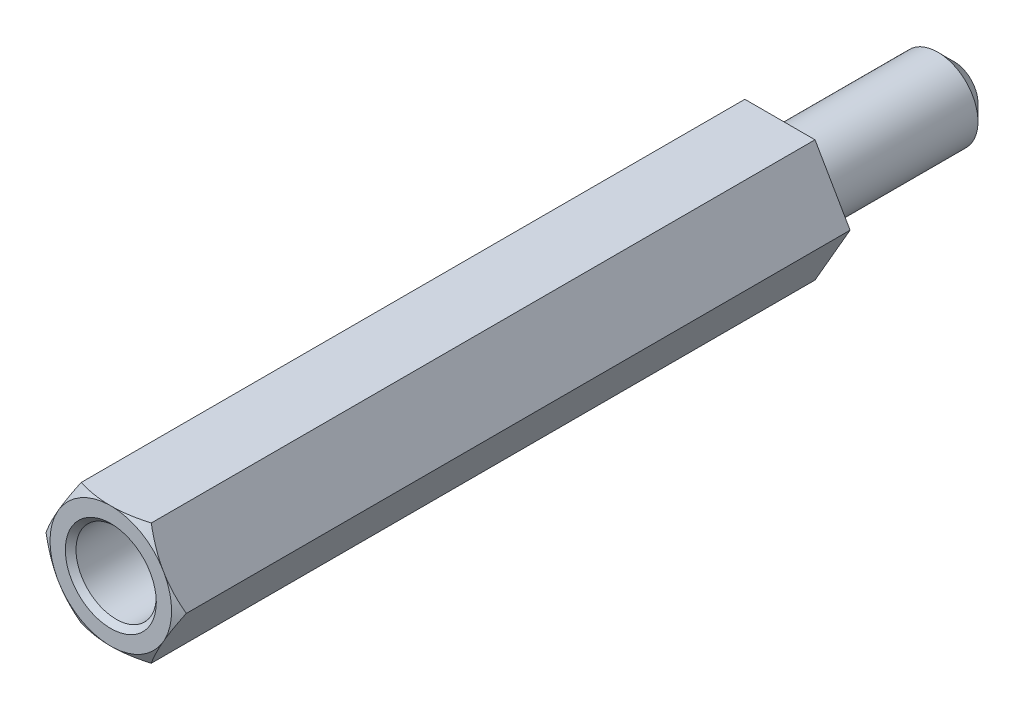
ISO-10303-21;
HEADER;
FILE_DESCRIPTION(('STEP AP214'),'2;1');
FILE_NAME('part.step','',(''),(''),'','','');
FILE_SCHEMA(('AUTOMOTIVE_DESIGN { 1 0 10303 214 1 1 1 1 }'));
ENDSEC;
DATA;
#1=APPLICATION_CONTEXT('core data for automotive mechanical design processes');
#2=APPLICATION_PROTOCOL_DEFINITION('international standard','automotive_design',2000,#1);
#3=PRODUCT_CONTEXT('',#1,'mechanical');
#4=PRODUCT('Part','Part','',(#3));
#5=PRODUCT_RELATED_PRODUCT_CATEGORY('part','',(#4));
#6=PRODUCT_DEFINITION_FORMATION('','',#4);
#7=PRODUCT_DEFINITION_CONTEXT('part definition',#1,'design');
#8=PRODUCT_DEFINITION('design','',#6,#7);
#9=PRODUCT_DEFINITION_SHAPE('','',#8);
#10=(LENGTH_UNIT() NAMED_UNIT(*) SI_UNIT(.MILLI.,.METRE.));
#11=(NAMED_UNIT(*) PLANE_ANGLE_UNIT() SI_UNIT($,.RADIAN.));
#12=(NAMED_UNIT(*) SI_UNIT($,.STERADIAN.) SOLID_ANGLE_UNIT());
#13=UNCERTAINTY_MEASURE_WITH_UNIT(LENGTH_MEASURE(1.E-05),#10,'distance_accuracy_value','');
#14=(GEOMETRIC_REPRESENTATION_CONTEXT(3) GLOBAL_UNCERTAINTY_ASSIGNED_CONTEXT((#13)) GLOBAL_UNIT_ASSIGNED_CONTEXT((#10,
#11,#12)) REPRESENTATION_CONTEXT('',''));
#15=CARTESIAN_POINT('',(0.,0.,0.));
#16=DIRECTION('',(0.,0.,1.));
#17=DIRECTION('',(1.,0.,0.));
#18=AXIS2_PLACEMENT_3D('',#15,#16,#17);
#19=CARTESIAN_POINT('',(0.,0.,25.));
#20=DIRECTION('',(0.,0.,1.));
#21=DIRECTION('',(1.,0.,0.));
#22=AXIS2_PLACEMENT_3D('',#19,#20,#21);
#23=PLANE('',#22);
#24=CARTESIAN_POINT('',(0.,0.,25.));
#25=DIRECTION('',(0.,0.,1.));
#26=DIRECTION('',(1.,0.,0.));
#27=AXIS2_PLACEMENT_3D('',#24,#25,#26);
#28=CIRCLE('',#27,1.7);
#29=CARTESIAN_POINT('',(1.7,0.,25.));
#30=VERTEX_POINT('',#29);
#31=EDGE_CURVE('E166',#30,#30,#28,.F.);
#32=ORIENTED_EDGE('',*,*,#31,.T.);
#33=EDGE_LOOP('',(#32));
#34=FACE_BOUND('',#33,.T.);
#35=CARTESIAN_POINT('',(0.,0.,25.));
#36=DIRECTION('',(0.,0.,1.));
#37=DIRECTION('',(1.,0.,0.));
#38=AXIS2_PLACEMENT_3D('',#35,#36,#37);
#39=CIRCLE('',#38,2.2711702221209);
#40=CARTESIAN_POINT('',(1.92942846272878,-1.19813187298426,25.));
#41=VERTEX_POINT('',#40);
#42=CARTESIAN_POINT('',(0.0728984077241233,-2.27,25.));
#43=VERTEX_POINT('',#42);
#44=EDGE_CURVE('E165',#41,#43,#39,.F.);
#45=ORIENTED_EDGE('',*,*,#44,.F.);
#46=DIRECTION('',(0.499999999999995,0.866025403784442,0.));
#47=VECTOR('',#46,1.);
#48=CARTESIAN_POINT('',(1.31058511106048,-2.26999999999999,25.));
#49=LINE('',#48,#47);
#50=CARTESIAN_POINT('',(2.0023268704526,-1.07186812701572,25.));
#51=VERTEX_POINT('',#50);
#52=EDGE_CURVE('E309',#41,#51,#49,.T.);
#53=ORIENTED_EDGE('',*,*,#52,.T.);
#54=CARTESIAN_POINT('',(2.00232687045273,1.07186812701549,25.));
#55=VERTEX_POINT('',#54);
#56=EDGE_CURVE('E162',#55,#51,#39,.F.);
#57=ORIENTED_EDGE('',*,*,#56,.F.);
#58=DIRECTION('',(-0.500000000000001,0.866025403784438,0.));
#59=VECTOR('',#58,1.);
#60=CARTESIAN_POINT('',(2.6211702221209,0.,25.));
#61=LINE('',#60,#59);
#62=CARTESIAN_POINT('',(1.92942846272862,1.19813187298452,25.));
#63=VERTEX_POINT('',#62);
#64=EDGE_CURVE('E321',#55,#63,#61,.T.);
#65=ORIENTED_EDGE('',*,*,#64,.T.);
#66=CARTESIAN_POINT('',(0.0728984077240917,2.27,25.));
#67=VERTEX_POINT('',#66);
#68=EDGE_CURVE('E164',#67,#63,#39,.F.);
#69=ORIENTED_EDGE('',*,*,#68,.F.);
#70=DIRECTION('',(-1.,0.,0.));
#71=VECTOR('',#70,1.);
#72=CARTESIAN_POINT('',(1.31058511106045,2.27,25.));
#73=LINE('',#72,#71);
#74=CARTESIAN_POINT('',(-0.0728984077241075,2.27,25.));
#75=VERTEX_POINT('',#74);
#76=EDGE_CURVE('E316',#67,#75,#73,.T.);
#77=ORIENTED_EDGE('',*,*,#76,.T.);
#78=CARTESIAN_POINT('',(-1.92942846272863,1.19813187298449,25.));
#79=VERTEX_POINT('',#78);
#80=EDGE_CURVE('E341',#79,#75,#39,.F.);
#81=ORIENTED_EDGE('',*,*,#80,.F.);
#82=DIRECTION('',(-0.499999999999995,-0.866025403784442,0.));
#83=VECTOR('',#82,1.);
#84=CARTESIAN_POINT('',(-1.31058511106046,2.27,25.));
#85=LINE('',#84,#83);
#86=CARTESIAN_POINT('',(-2.00232687045273,1.07186812701548,25.));
#87=VERTEX_POINT('',#86);
#88=EDGE_CURVE('E315',#79,#87,#85,.T.);
#89=ORIENTED_EDGE('',*,*,#88,.T.);
#90=CARTESIAN_POINT('',(-2.00232687045272,-1.0718681270155,25.));
#91=VERTEX_POINT('',#90);
#92=EDGE_CURVE('E126',#91,#87,#39,.F.);
#93=ORIENTED_EDGE('',*,*,#92,.F.);
#94=DIRECTION('',(0.500000000000007,-0.866025403784435,0.));
#95=VECTOR('',#94,1.);
#96=CARTESIAN_POINT('',(-2.6211702221209,0.,25.));
#97=LINE('',#96,#95);
#98=CARTESIAN_POINT('',(-1.92942846272861,-1.19813187298453,25.));
#99=VERTEX_POINT('',#98);
#100=EDGE_CURVE('E142',#91,#99,#97,.T.);
#101=ORIENTED_EDGE('',*,*,#100,.T.);
#102=CARTESIAN_POINT('',(-0.0728984077240759,-2.27,25.));
#103=VERTEX_POINT('',#102);
#104=EDGE_CURVE('E332',#103,#99,#39,.F.);
#105=ORIENTED_EDGE('',*,*,#104,.F.);
#106=DIRECTION('',(1.,0.,0.));
#107=VECTOR('',#106,1.);
#108=CARTESIAN_POINT('',(-1.31058511106043,-2.27000000000001,25.));
#109=LINE('',#108,#107);
#110=EDGE_CURVE('E301',#103,#43,#109,.T.);
#111=ORIENTED_EDGE('',*,*,#110,.T.);
#112=EDGE_LOOP('',(#45,#53,#57,#65,#69,#77,#81,#89,#93,#101,#105,#111));
#113=FACE_BOUND('',#112,.T.);
#114=ADVANCED_FACE('F37',(#34,#113),#23,.T.);
#115=CARTESIAN_POINT('',(1.31058511106048,-2.26999999999999,25.));
#116=DIRECTION('',(-0.866025403784442,0.499999999999995,0.));
#117=DIRECTION('',(-0.499999999999995,-0.866025403784442,0.));
#118=AXIS2_PLACEMENT_3D('',#115,#116,#117);
#119=PLANE('',#118);
#120=DIRECTION('',(0.,0.,-1.));
#121=VECTOR('',#120,1.);
#122=CARTESIAN_POINT('',(2.6211702221209,0.,25.));
#123=LINE('',#122,#121);
#124=CARTESIAN_POINT('',(2.6211702221209,0.,24.8));
#125=VERTEX_POINT('',#124);
#126=CARTESIAN_POINT('',(2.6211702221209,0.,0.));
#127=VERTEX_POINT('',#126);
#128=EDGE_CURVE('E160',#125,#127,#123,.T.);
#129=ORIENTED_EDGE('',*,*,#128,.F.);
#130=CARTESIAN_POINT('',(3.53192502802619,1.5774735970655,24.0874155357182));
#131=CARTESIAN_POINT('',(3.49038683177578,1.50552733070503,24.1258459368283));
#132=CARTESIAN_POINT('',(3.44875020540645,1.43341057837758,24.1638565423728));
#133=CARTESIAN_POINT('',(3.36523806633925,1.28876331046444,24.2388408708484));
#134=CARTESIAN_POINT('',(3.32336252393505,1.21623274342586,24.2758144613019));
#135=CARTESIAN_POINT('',(3.2392041639013,1.07046618796572,24.3486360571844));
#136=CARTESIAN_POINT('',(3.19692046373752,0.997228670950053,24.3844800017565));
#137=CARTESIAN_POINT('',(3.11203872815441,0.850209192285469,24.4546361454567));
#138=CARTESIAN_POINT('',(3.06944070287604,0.776427248201227,24.4889483937519));
#139=CARTESIAN_POINT('',(2.93902958582733,0.550548567601059,24.5907324723442));
#140=CARTESIAN_POINT('',(2.85063034563923,0.397436592244786,24.6552582519314));
#141=CARTESIAN_POINT('',(2.67192637782696,0.0879122404797772,24.7724545253547));
#142=CARTESIAN_POINT('',(2.58162393222904,-0.0684961833435604,24.8251384219436));
#143=CARTESIAN_POINT('',(2.42693241398783,-0.336429752437301,24.8992654299313));
#144=CARTESIAN_POINT('',(2.36310804900723,-0.446976795344526,24.9253337082215));
#145=CARTESIAN_POINT('',(2.23458545503781,-0.669584458020103,24.9666715963234));
#146=CARTESIAN_POINT('',(2.16988756118547,-0.781644497315057,24.9819452339838));
#147=CARTESIAN_POINT('',(2.04077595171338,-1.00527236476771,24.9998836306583));
#148=CARTESIAN_POINT('',(1.97636731130572,-1.11683140240021,25.0026891812466));
#149=CARTESIAN_POINT('',(1.84772217135019,-1.33965132095001,24.9957318097908));
#150=CARTESIAN_POINT('',(1.78348569252727,-1.45091216597063,24.9859674371621));
#151=CARTESIAN_POINT('',(1.63030365883246,-1.71623123113677,24.948841102754));
#152=CARTESIAN_POINT('',(1.54169424329176,-1.86970724088225,24.9160238630181));
#153=CARTESIAN_POINT('',(1.36642171508061,-2.173288164915,24.8337386865889));
#154=CARTESIAN_POINT('',(1.27976131396277,-2.32338838265541,24.7842489190442));
#155=CARTESIAN_POINT('',(1.10733311832963,-2.62204277814945,24.6734296043507));
#156=CARTESIAN_POINT('',(1.02158612689548,-2.77056092390956,24.6119739052285));
#157=CARTESIAN_POINT('',(0.85162252698669,-3.0649465143889,24.4814839194209));
#158=CARTESIAN_POINT('',(0.767405153907273,-3.21081528344244,24.4124535477672));
#159=CARTESIAN_POINT('',(0.635892107966399,-3.43860256087017,24.2999058489882));
#160=CARTESIAN_POINT('',(0.588222071353315,-3.52116948628271,24.258115008667));
#161=CARTESIAN_POINT('',(0.493605207664306,-3.68505070144489,24.1735241810497));
#162=CARTESIAN_POINT('',(0.446655700740952,-3.76636963282645,24.1307361997354));
#163=CARTESIAN_POINT('',(0.399830305155195,-3.84747359706549,24.0874155357182));
#164=B_SPLINE_CURVE_WITH_KNOTS('',3,(#130,#131,#132,#133,#134,#135,#136,#137,#138,#139,#140,
#141,#142,#143,#144,#145,#146,#147,#148,#149,#150,#151,#152,#153,#154,#155,#156,#157,#158,#159,
#160,#161,#162,#163),.UNSPECIFIED.,.F.,.F.,(4,2,2,2,2,2,2,2,2,2,2,2,2,2,2,2,4),(0.,
0.274606048832121,0.549247019939769,0.82478302101826,1.10031017110167,1.66467514911565,
2.22839812072206,2.61888273310893,3.00922156533175,3.39514124414463,3.78110546255825,
4.32061090335238,4.8608255310685,5.40707820220996,5.95304985633502,6.26533246804877,
6.57488685439787),.UNSPECIFIED.);
#165=EDGE_CURVE('E299',#125,#51,#164,.T.);
#166=ORIENTED_EDGE('',*,*,#165,.T.);
#167=ORIENTED_EDGE('',*,*,#52,.F.);
#168=CARTESIAN_POINT('',(1.31058511106048,-2.26999999999999,24.8));
#169=VERTEX_POINT('',#168);
#170=EDGE_CURVE('E143',#41,#169,#164,.T.);
#171=ORIENTED_EDGE('',*,*,#170,.T.);
#172=DIRECTION('',(0.,0.,-1.));
#173=VECTOR('',#172,1.);
#174=CARTESIAN_POINT('',(1.31058511106048,-2.26999999999999,25.));
#175=LINE('',#174,#173);
#176=CARTESIAN_POINT('',(1.31058511106048,-2.26999999999999,0.));
#177=VERTEX_POINT('',#176);
#178=EDGE_CURVE('E155',#169,#177,#175,.T.);
#179=ORIENTED_EDGE('',*,*,#178,.T.);
#180=DIRECTION('',(0.499999999999995,0.866025403784442,0.));
#181=VECTOR('',#180,1.);
#182=CARTESIAN_POINT('',(1.31058511106048,-2.26999999999999,0.));
#183=LINE('',#182,#181);
#184=EDGE_CURVE('E287',#177,#127,#183,.T.);
#185=ORIENTED_EDGE('',*,*,#184,.T.);
#186=EDGE_LOOP('',(#129,#166,#167,#171,#179,#185));
#187=FACE_BOUND('',#186,.T.);
#188=ADVANCED_FACE('F248',(#187),#119,.F.);
#189=CARTESIAN_POINT('',(2.6211702221209,0.,25.));
#190=DIRECTION('',(-0.866025403784438,-0.500000000000001,0.));
#191=DIRECTION('',(0.500000000000001,-0.866025403784438,0.));
#192=AXIS2_PLACEMENT_3D('',#189,#190,#191);
#193=PLANE('',#192);
#194=DIRECTION('',(0.,0.,-1.));
#195=VECTOR('',#194,1.);
#196=CARTESIAN_POINT('',(1.31058511106045,2.27,25.));
#197=LINE('',#196,#195);
#198=CARTESIAN_POINT('',(1.31058511106045,2.27,24.8));
#199=VERTEX_POINT('',#198);
#200=CARTESIAN_POINT('',(1.31058511106045,2.27,0.));
#201=VERTEX_POINT('',#200);
#202=EDGE_CURVE('E153',#199,#201,#197,.T.);
#203=ORIENTED_EDGE('',*,*,#202,.F.);
#204=CARTESIAN_POINT('',(0.399830305155137,3.84747359706553,24.0874155357182));
#205=CARTESIAN_POINT('',(0.441368501405547,3.77552733070505,24.1258459368283));
#206=CARTESIAN_POINT('',(0.483005127774877,3.70341057837761,24.1638565423728));
#207=CARTESIAN_POINT('',(0.566517266842073,3.55876331046447,24.2388408708484));
#208=CARTESIAN_POINT('',(0.608392809246276,3.48623274342589,24.2758144613019));
#209=CARTESIAN_POINT('',(0.692551169280029,3.34046618796575,24.3486360571844));
#210=CARTESIAN_POINT('',(0.734834869443806,3.26722867095008,24.3844800017564));
#211=CARTESIAN_POINT('',(0.819716605026922,3.1202091922855,24.4546361454567));
#212=CARTESIAN_POINT('',(0.862314630305293,3.04642724820126,24.4889483937519));
#213=CARTESIAN_POINT('',(0.992725747353997,2.82054856760109,24.5907324723442));
#214=CARTESIAN_POINT('',(1.0811249875421,2.66743659224481,24.6552582519314));
#215=CARTESIAN_POINT('',(1.25982895535437,2.35791224047981,24.7724545253547));
#216=CARTESIAN_POINT('',(1.3501314009523,2.20150381665647,24.8251384219436));
#217=CARTESIAN_POINT('',(1.50482291919351,1.93357024756273,24.8992654299313));
#218=CARTESIAN_POINT('',(1.56864728417411,1.82302320465551,24.9253337082215));
#219=CARTESIAN_POINT('',(1.69716987814353,1.60041554197993,24.9666715963234));
#220=CARTESIAN_POINT('',(1.76186777199587,1.48835550268498,24.9819452339838));
#221=CARTESIAN_POINT('',(1.89097938146796,1.26472763523233,24.9998836306583));
#222=CARTESIAN_POINT('',(1.95538802187562,1.15316859759983,25.0026891812466));
#223=CARTESIAN_POINT('',(2.08403316183115,0.930348679050028,24.9957318097908));
#224=CARTESIAN_POINT('',(2.14826964065407,0.81908783402941,24.9859674371621));
#225=CARTESIAN_POINT('',(2.30145167434888,0.553768768863274,24.9488411027541));
#226=CARTESIAN_POINT('',(2.39006108988958,0.400292759117801,24.9160238630181));
#227=CARTESIAN_POINT('',(2.56533361810072,0.0967118350850608,24.8337386865889));
#228=CARTESIAN_POINT('',(2.65199401921856,-0.0533883826553423,24.7842489190442));
#229=CARTESIAN_POINT('',(2.8244222148517,-0.352042778149366,24.6734296043507));
#230=CARTESIAN_POINT('',(2.91016920628585,-0.500560923909474,24.6119739052286));
#231=CARTESIAN_POINT('',(3.08013280619464,-0.794946514388807,24.4814839194209));
#232=CARTESIAN_POINT('',(3.16435017927405,-0.940815283442338,24.4124535477672));
#233=CARTESIAN_POINT('',(3.29586322521494,-1.16860256087009,24.2999058489882));
#234=CARTESIAN_POINT('',(3.34353326182804,-1.25116948628265,24.258115008667));
#235=CARTESIAN_POINT('',(3.43815012551707,-1.41505070144488,24.1735241810497));
#236=CARTESIAN_POINT('',(3.48509963244044,-1.49636963282646,24.1307361997354));
#237=CARTESIAN_POINT('',(3.53192502802621,-1.57747359706552,24.0874155357182));
#238=B_SPLINE_CURVE_WITH_KNOTS('',3,(#204,#205,#206,#207,#208,#209,#210,#211,#212,#213,#214,
#215,#216,#217,#218,#219,#220,#221,#222,#223,#224,#225,#226,#227,#228,#229,#230,#231,#232,#233,
#234,#235,#236,#237),.UNSPECIFIED.,.F.,.F.,(4,2,2,2,2,2,2,2,2,2,2,2,2,2,2,2,4),(0.,
0.274606048832119,0.549247019939769,0.82478302101826,1.10031017110167,1.66467514911565,
2.22839812072207,2.61888273310893,3.00922156533175,3.39514124414464,3.78110546255825,
4.32061090335236,4.86082553106846,5.40707820220991,5.95304985633495,6.26533246804878,
6.57488685439797),.UNSPECIFIED.);
#239=EDGE_CURVE('E233',#199,#63,#238,.T.);
#240=ORIENTED_EDGE('',*,*,#239,.T.);
#241=ORIENTED_EDGE('',*,*,#64,.F.);
#242=EDGE_CURVE('E330',#55,#125,#238,.T.);
#243=ORIENTED_EDGE('',*,*,#242,.T.);
#244=ORIENTED_EDGE('',*,*,#128,.T.);
#245=DIRECTION('',(-0.500000000000001,0.866025403784438,0.));
#246=VECTOR('',#245,1.);
#247=CARTESIAN_POINT('',(2.6211702221209,0.,0.));
#248=LINE('',#247,#246);
#249=EDGE_CURVE('E292',#127,#201,#248,.T.);
#250=ORIENTED_EDGE('',*,*,#249,.T.);
#251=EDGE_LOOP('',(#203,#240,#241,#243,#244,#250));
#252=FACE_BOUND('',#251,.T.);
#253=ADVANCED_FACE('F243',(#252),#193,.F.);
#254=CARTESIAN_POINT('',(1.31058511106045,2.27,25.));
#255=DIRECTION('',(0.,-1.,0.));
#256=DIRECTION('',(1.,0.,0.));
#257=AXIS2_PLACEMENT_3D('',#254,#255,#256);
#258=PLANE('',#257);
#259=DIRECTION('',(0.,0.,-1.));
#260=VECTOR('',#259,1.);
#261=CARTESIAN_POINT('',(-1.31058511106046,2.27,25.));
#262=LINE('',#261,#260);
#263=CARTESIAN_POINT('',(-1.31058511106046,2.27,24.8));
#264=VERTEX_POINT('',#263);
#265=CARTESIAN_POINT('',(-1.31058511106046,2.27,0.));
#266=VERTEX_POINT('',#265);
#267=EDGE_CURVE('E150',#264,#266,#262,.T.);
#268=ORIENTED_EDGE('',*,*,#267,.F.);
#269=CARTESIAN_POINT('',(-2.88805870812598,2.26999999999999,24.1987324103344));
#270=CARTESIAN_POINT('',(-2.80547290408561,2.26999999999999,24.2358255324642));
#271=CARTESIAN_POINT('',(-2.72266390787582,2.26999999999999,24.2724300278097));
#272=CARTESIAN_POINT('',(-2.55650266128481,2.26999999999999,24.3444249566602));
#273=CARTESIAN_POINT('',(-2.47315031505662,2.26999999999999,24.3798151686687));
#274=CARTESIAN_POINT('',(-2.30548338672952,2.26999999999999,24.4492769222981));
#275=CARTESIAN_POINT('',(-2.22116623150815,2.26999999999999,24.4833422884396));
#276=CARTESIAN_POINT('',(-2.05182779905439,2.26999999999999,24.5496595457378));
#277=CARTESIAN_POINT('',(-1.96680655448942,2.26999999999999,24.5819115204949));
#278=CARTESIAN_POINT('',(-1.71138311857313,2.26999999999999,24.6750656041859));
#279=CARTESIAN_POINT('',(-1.53976972748373,2.26999999999999,24.7327268658694));
#280=CARTESIAN_POINT('',(-1.19280228070998,2.27,24.8349421604164));
#281=CARTESIAN_POINT('',(-1.01745424532612,2.27,24.879515794802));
#282=CARTESIAN_POINT('',(-0.71209077138909,2.27,24.9400719954737));
#283=CARTESIAN_POINT('',(-0.582987722953625,2.27,24.9605553386303));
#284=CARTESIAN_POINT('',(-0.323439084569055,2.27,24.989581233522));
#285=CARTESIAN_POINT('',(-0.192993977067347,2.27,24.9981279349084));
#286=CARTESIAN_POINT('',(0.0680599454393762,2.27,25.0022273630874));
#287=CARTESIAN_POINT('',(0.198668678458181,2.27,24.9977850727737));
#288=CARTESIAN_POINT('',(0.458851198221927,2.27,24.976485692699));
#289=CARTESIAN_POINT('',(0.588424742955677,2.27,24.9596257810572));
#290=CARTESIAN_POINT('',(0.904937752962719,2.27,24.9051607953018));
#291=CARTESIAN_POINT('',(1.09083477493521,2.27,24.8615794043185));
#292=CARTESIAN_POINT('',(1.36639728986909,2.27,24.7844964765957));
#293=CARTESIAN_POINT('',(1.45781153661096,2.27,24.7568102536344));
#294=CARTESIAN_POINT('',(1.63961899594481,2.27000000000001,24.6982591090532));
#295=CARTESIAN_POINT('',(1.73001229033944,2.27000000000001,24.6673944441364));
#296=CARTESIAN_POINT('',(1.91077257487061,2.27000000000001,24.6027837141474));
#297=CARTESIAN_POINT('',(2.00113026057096,2.27000000000001,24.5690119189924));
#298=CARTESIAN_POINT('',(2.18103313876788,2.27000000000001,24.499360278944));
#299=CARTESIAN_POINT('',(2.27057828364603,2.27000000000001,24.4634803114121));
#300=CARTESIAN_POINT('',(2.44846011178725,2.27000000000001,24.3902269588395));
#301=CARTESIAN_POINT('',(2.53680076536778,2.27000000000001,24.352863166806));
#302=CARTESIAN_POINT('',(2.71286376090329,2.27000000000001,24.2767584059864));
#303=CARTESIAN_POINT('',(2.80058623966965,2.27000000000001,24.2380177541729));
#304=CARTESIAN_POINT('',(2.88805870812597,2.27000000000001,24.1987324103344));
#305=B_SPLINE_CURVE_WITH_KNOTS('',3,(#269,#270,#271,#272,#273,#274,#275,#276,#277,#278,#279,
#280,#281,#282,#283,#284,#285,#286,#287,#288,#289,#290,#291,#292,#293,#294,#295,#296,#297,#298,
#299,#300,#301,#302,#303,#304),.UNSPECIFIED.,.F.,.F.,(4,2,2,2,2,2,2,2,2,2,2,2,2,2,2,2,2,4),(0.,
0.271603728461578,0.543256739373973,0.816052841064959,1.08883635604999,1.63163153509609,
2.17360956621752,2.5653004176683,2.95685506788359,3.34825952790363,3.73975296129818,
4.31141566486302,4.59793246001128,4.88442613310069,5.17378506531958,5.46316084709716,
5.75090015934329,6.03857365362724),.UNSPECIFIED.);
#306=EDGE_CURVE('E225',#264,#75,#305,.T.);
#307=ORIENTED_EDGE('',*,*,#306,.T.);
#308=ORIENTED_EDGE('',*,*,#76,.F.);
#309=EDGE_CURVE('E232',#67,#199,#305,.T.);
#310=ORIENTED_EDGE('',*,*,#309,.T.);
#311=ORIENTED_EDGE('',*,*,#202,.T.);
#312=DIRECTION('',(-1.,0.,0.));
#313=VECTOR('',#312,1.);
#314=CARTESIAN_POINT('',(1.31058511106045,2.27,0.));
#315=LINE('',#314,#313);
#316=EDGE_CURVE('E296',#201,#266,#315,.T.);
#317=ORIENTED_EDGE('',*,*,#316,.T.);
#318=EDGE_LOOP('',(#268,#307,#308,#310,#311,#317));
#319=FACE_BOUND('',#318,.T.);
#320=ADVANCED_FACE('F240',(#319),#258,.F.);
#321=CARTESIAN_POINT('',(-1.31058511106046,2.27,25.));
#322=DIRECTION('',(0.866025403784442,-0.499999999999995,0.));
#323=DIRECTION('',(0.499999999999995,0.866025403784442,0.));
#324=AXIS2_PLACEMENT_3D('',#321,#322,#323);
#325=PLANE('',#324);
#326=DIRECTION('',(0.,0.,-1.));
#327=VECTOR('',#326,1.);
#328=CARTESIAN_POINT('',(-2.6211702221209,0.,25.));
#329=LINE('',#328,#327);
#330=CARTESIAN_POINT('',(-2.6211702221209,0.,24.8));
#331=VERTEX_POINT('',#330);
#332=CARTESIAN_POINT('',(-2.6211702221209,0.,0.));
#333=VERTEX_POINT('',#332);
#334=EDGE_CURVE('E138',#331,#333,#329,.T.);
#335=ORIENTED_EDGE('',*,*,#334,.F.);
#336=CARTESIAN_POINT('',(-3.5319250280262,-1.57747359706554,24.0874155357182));
#337=CARTESIAN_POINT('',(-3.49038683177579,-1.50552733070506,24.1258459368283));
#338=CARTESIAN_POINT('',(-3.44875020540646,-1.43341057837762,24.1638565423728));
#339=CARTESIAN_POINT('',(-3.36523806633926,-1.28876331046448,24.2388408708484));
#340=CARTESIAN_POINT('',(-3.32336252393506,-1.21623274342589,24.2758144613019));
#341=CARTESIAN_POINT('',(-3.23920416390131,-1.07046618796576,24.3486360571844));
#342=CARTESIAN_POINT('',(-3.19692046373753,-0.997228670950091,24.3844800017564));
#343=CARTESIAN_POINT('',(-3.11203872815442,-0.850209192285507,24.4546361454567));
#344=CARTESIAN_POINT('',(-3.06944070287605,-0.776427248201264,24.4889483937519));
#345=CARTESIAN_POINT('',(-2.93902958582734,-0.550548567601097,24.5907324723442));
#346=CARTESIAN_POINT('',(-2.85063034563924,-0.397436592244823,24.6552582519314));
#347=CARTESIAN_POINT('',(-2.67192637782697,-0.0879122404798137,24.7724545253547));
#348=CARTESIAN_POINT('',(-2.58162393222905,0.0684961833435233,24.8251384219436));
#349=CARTESIAN_POINT('',(-2.42693241398784,0.336429752437263,24.8992654299313));
#350=CARTESIAN_POINT('',(-2.36310804900724,0.446976795344488,24.9253337082215));
#351=CARTESIAN_POINT('',(-2.23458545503782,0.669584458020064,24.9666715963234));
#352=CARTESIAN_POINT('',(-2.16988756118548,0.781644497315017,24.9819452339838));
#353=CARTESIAN_POINT('',(-2.04077595171339,1.00527236476767,24.9998836306583));
#354=CARTESIAN_POINT('',(-1.97636731130574,1.11683140240017,25.0026891812466));
#355=CARTESIAN_POINT('',(-1.8477221713502,1.33965132094997,24.9957318097908));
#356=CARTESIAN_POINT('',(-1.78348569252728,1.45091216597059,24.9859674371621));
#357=CARTESIAN_POINT('',(-1.63030365883247,1.71623123113673,24.9488411027541));
#358=CARTESIAN_POINT('',(-1.54169424329178,1.8697072408822,24.9160238630181));
#359=CARTESIAN_POINT('',(-1.36642171508064,2.17328816491494,24.8337386865889));
#360=CARTESIAN_POINT('',(-1.2797613139628,2.32338838265535,24.7842489190442));
#361=CARTESIAN_POINT('',(-1.10733311832966,2.62204277814937,24.6734296043507));
#362=CARTESIAN_POINT('',(-1.02158612689552,2.77056092390948,24.6119739052286));
#363=CARTESIAN_POINT('',(-0.851622526986727,3.06494651438882,24.4814839194209));
#364=CARTESIAN_POINT('',(-0.767405153907312,3.21081528344235,24.4124535477672));
#365=CARTESIAN_POINT('',(-0.635892107966427,3.4386025608701,24.2999058489882));
#366=CARTESIAN_POINT('',(-0.588222071353332,3.52116948628266,24.258115008667));
#367=CARTESIAN_POINT('',(-0.493605207664301,3.68505070144488,24.1735241810497));
#368=CARTESIAN_POINT('',(-0.446655700740936,3.76636963282646,24.1307361997354));
#369=CARTESIAN_POINT('',(-0.399830305155167,3.84747359706552,24.0874155357182));
#370=B_SPLINE_CURVE_WITH_KNOTS('',3,(#336,#337,#338,#339,#340,#341,#342,#343,#344,#345,#346,
#347,#348,#349,#350,#351,#352,#353,#354,#355,#356,#357,#358,#359,#360,#361,#362,#363,#364,#365,
#366,#367,#368,#369),.UNSPECIFIED.,.F.,.F.,(4,2,2,2,2,2,2,2,2,2,2,2,2,2,2,2,4),(0.,
0.274606048832121,0.549247019939769,0.824783021018259,1.10031017110167,1.66467514911565,
2.22839812072206,2.61888273310893,3.00922156533175,3.39514124414463,3.78110546255824,
4.32061090335236,4.86082553106847,5.40707820220992,5.95304985633496,6.26533246804878,
6.57488685439796),.UNSPECIFIED.);
#371=EDGE_CURVE('E124',#331,#87,#370,.T.);
#372=ORIENTED_EDGE('',*,*,#371,.T.);
#373=ORIENTED_EDGE('',*,*,#88,.F.);
#374=EDGE_CURVE('E131',#79,#264,#370,.T.);
#375=ORIENTED_EDGE('',*,*,#374,.T.);
#376=ORIENTED_EDGE('',*,*,#267,.T.);
#377=DIRECTION('',(-0.499999999999995,-0.866025403784442,0.));
#378=VECTOR('',#377,1.);
#379=CARTESIAN_POINT('',(-1.31058511106046,2.27,0.));
#380=LINE('',#379,#378);
#381=EDGE_CURVE('E148',#266,#333,#380,.T.);
#382=ORIENTED_EDGE('',*,*,#381,.T.);
#383=EDGE_LOOP('',(#335,#372,#373,#375,#376,#382));
#384=FACE_BOUND('',#383,.T.);
#385=ADVANCED_FACE('F146',(#384),#325,.F.);
#386=CARTESIAN_POINT('',(-2.6211702221209,0.,25.));
#387=DIRECTION('',(0.866025403784435,0.500000000000007,0.));
#388=DIRECTION('',(-0.500000000000007,0.866025403784435,0.));
#389=AXIS2_PLACEMENT_3D('',#386,#387,#388);
#390=PLANE('',#389);
#391=DIRECTION('',(0.,0.,-1.));
#392=VECTOR('',#391,1.);
#393=CARTESIAN_POINT('',(-1.31058511106043,-2.27000000000001,25.));
#394=LINE('',#393,#392);
#395=CARTESIAN_POINT('',(-1.31058511106043,-2.27000000000001,24.8));
#396=VERTEX_POINT('',#395);
#397=CARTESIAN_POINT('',(-1.31058511106043,-2.27000000000001,0.));
#398=VERTEX_POINT('',#397);
#399=EDGE_CURVE('E151',#396,#398,#394,.T.);
#400=ORIENTED_EDGE('',*,*,#399,.F.);
#401=CARTESIAN_POINT('',(-0.399830305155106,-3.84747359706554,24.0874155357182));
#402=CARTESIAN_POINT('',(-0.441368501405517,-3.77552733070506,24.1258459368283));
#403=CARTESIAN_POINT('',(-0.483005127774847,-3.70341057837762,24.1638565423728));
#404=CARTESIAN_POINT('',(-0.566517266842044,-3.55876331046448,24.2388408708484));
#405=CARTESIAN_POINT('',(-0.608392809246248,-3.48623274342589,24.2758144613019));
#406=CARTESIAN_POINT('',(-0.692551169280002,-3.34046618796576,24.3486360571844));
#407=CARTESIAN_POINT('',(-0.73483486944378,-3.26722867095009,24.3844800017564));
#408=CARTESIAN_POINT('',(-0.819716605026896,-3.12020919228551,24.4546361454567));
#409=CARTESIAN_POINT('',(-0.862314630305268,-3.04642724820127,24.4889483937519));
#410=CARTESIAN_POINT('',(-0.992725747353973,-2.8205485676011,24.5907324723442));
#411=CARTESIAN_POINT('',(-1.08112498754207,-2.66743659224483,24.6552582519314));
#412=CARTESIAN_POINT('',(-1.25982895535435,-2.35791224047982,24.7724545253547));
#413=CARTESIAN_POINT('',(-1.35013140095228,-2.20150381665648,24.8251384219436));
#414=CARTESIAN_POINT('',(-1.50482291919349,-1.93357024756275,24.8992654299313));
#415=CARTESIAN_POINT('',(-1.56864728417409,-1.82302320465552,24.9253337082215));
#416=CARTESIAN_POINT('',(-1.69716987814351,-1.60041554197995,24.9666715963234));
#417=CARTESIAN_POINT('',(-1.76186777199585,-1.48835550268499,24.9819452339838));
#418=CARTESIAN_POINT('',(-1.89097938146795,-1.26472763523234,24.9998836306583));
#419=CARTESIAN_POINT('',(-1.95538802187561,-1.15316859759985,25.0026891812466));
#420=CARTESIAN_POINT('',(-2.08403316183115,-0.930348679050046,24.9957318097908));
#421=CARTESIAN_POINT('',(-2.14826964065407,-0.819087834029428,24.9859674371621));
#422=CARTESIAN_POINT('',(-2.30145167434888,-0.553768768863294,24.9488411027541));
#423=CARTESIAN_POINT('',(-2.39006108988958,-0.400292759117823,24.9160238630181));
#424=CARTESIAN_POINT('',(-2.56533361810072,-0.0967118350850837,24.8337386865889));
#425=CARTESIAN_POINT('',(-2.65199401921856,0.0533883826553187,24.7842489190442));
#426=CARTESIAN_POINT('',(-2.8244222148517,0.352042778149341,24.6734296043507));
#427=CARTESIAN_POINT('',(-2.91016920628585,0.500560923909448,24.6119739052286));
#428=CARTESIAN_POINT('',(-3.08013280619464,0.794946514388779,24.4814839194209));
#429=CARTESIAN_POINT('',(-3.16435017927405,0.940815283442308,24.4124535477672));
#430=CARTESIAN_POINT('',(-3.29586322521494,1.16860256087007,24.2999058489882));
#431=CARTESIAN_POINT('',(-3.34353326182804,1.25116948628262,24.258115008667));
#432=CARTESIAN_POINT('',(-3.43815012551708,1.41505070144485,24.1735241810497));
#433=CARTESIAN_POINT('',(-3.48509963244045,1.49636963282644,24.1307361997354));
#434=CARTESIAN_POINT('',(-3.53192502802623,1.5774735970655,24.0874155357182));
#435=B_SPLINE_CURVE_WITH_KNOTS('',3,(#401,#402,#403,#404,#405,#406,#407,#408,#409,#410,#411,
#412,#413,#414,#415,#416,#417,#418,#419,#420,#421,#422,#423,#424,#425,#426,#427,#428,#429,#430,
#431,#432,#433,#434),.UNSPECIFIED.,.F.,.F.,(4,2,2,2,2,2,2,2,2,2,2,2,2,2,2,2,4),(0.,
0.274606048832122,0.54924701993977,0.824783021018261,1.10031017110167,1.66467514911565,
2.22839812072207,2.61888273310894,3.00922156533176,3.39514124414464,3.78110546255825,
4.32061090335237,4.86082553106847,5.40707820220991,5.95304985633495,6.26533246804879,
6.57488685439799),.UNSPECIFIED.);
#436=EDGE_CURVE('E145',#396,#99,#435,.T.);
#437=ORIENTED_EDGE('',*,*,#436,.T.);
#438=ORIENTED_EDGE('',*,*,#100,.F.);
#439=EDGE_CURVE('E60',#91,#331,#435,.T.);
#440=ORIENTED_EDGE('',*,*,#439,.T.);
#441=ORIENTED_EDGE('',*,*,#334,.T.);
#442=DIRECTION('',(0.500000000000007,-0.866025403784435,0.));
#443=VECTOR('',#442,1.);
#444=CARTESIAN_POINT('',(-2.6211702221209,0.,0.));
#445=LINE('',#444,#443);
#446=EDGE_CURVE('E307',#333,#398,#445,.T.);
#447=ORIENTED_EDGE('',*,*,#446,.T.);
#448=EDGE_LOOP('',(#400,#437,#438,#440,#441,#447));
#449=FACE_BOUND('',#448,.T.);
#450=ADVANCED_FACE('F136',(#449),#390,.F.);
#451=CARTESIAN_POINT('',(-1.31058511106043,-2.27000000000001,25.));
#452=DIRECTION('',(0.,1.,0.));
#453=DIRECTION('',(-1.,0.,0.));
#454=AXIS2_PLACEMENT_3D('',#451,#452,#453);
#455=PLANE('',#454);
#456=ORIENTED_EDGE('',*,*,#178,.F.);
#457=CARTESIAN_POINT('',(2.888058708126,-2.26999999999997,24.1987324103344));
#458=CARTESIAN_POINT('',(2.80547290408563,-2.26999999999997,24.2358255324642));
#459=CARTESIAN_POINT('',(2.72266390787583,-2.26999999999997,24.2724300278097));
#460=CARTESIAN_POINT('',(2.55650266128482,-2.26999999999997,24.3444249566602));
#461=CARTESIAN_POINT('',(2.47315031505664,-2.26999999999997,24.3798151686687));
#462=CARTESIAN_POINT('',(2.30548338672954,-2.26999999999998,24.4492769222981));
#463=CARTESIAN_POINT('',(2.22116623150817,-2.26999999999998,24.4833422884396));
#464=CARTESIAN_POINT('',(2.05182779905441,-2.26999999999998,24.5496595457378));
#465=CARTESIAN_POINT('',(1.96680655448943,-2.26999999999998,24.5819115204949));
#466=CARTESIAN_POINT('',(1.71138311857314,-2.26999999999998,24.6750656041859));
#467=CARTESIAN_POINT('',(1.53976972748375,-2.26999999999998,24.7327268658694));
#468=CARTESIAN_POINT('',(1.19280228071,-2.26999999999999,24.8349421604164));
#469=CARTESIAN_POINT('',(1.01745424532613,-2.26999999999999,24.879515794802));
#470=CARTESIAN_POINT('',(0.712090771389104,-2.26999999999999,24.9400719954737));
#471=CARTESIAN_POINT('',(0.582987722953639,-2.26999999999999,24.9605553386303));
#472=CARTESIAN_POINT('',(0.323439084569069,-2.27,24.989581233522));
#473=CARTESIAN_POINT('',(0.19299397706736,-2.27,24.9981279349084));
#474=CARTESIAN_POINT('',(-0.0680599454393634,-2.27,25.0022273630874));
#475=CARTESIAN_POINT('',(-0.198668678458168,-2.27,24.9977850727737));
#476=CARTESIAN_POINT('',(-0.458851198221915,-2.27,24.976485692699));
#477=CARTESIAN_POINT('',(-0.588424742955665,-2.27000000000001,24.9596257810572));
#478=CARTESIAN_POINT('',(-0.904937752962707,-2.27000000000001,24.9051607953018));
#479=CARTESIAN_POINT('',(-1.0908347749352,-2.27000000000001,24.8615794043185));
#480=CARTESIAN_POINT('',(-1.36639728986908,-2.27000000000001,24.7844964765957));
#481=CARTESIAN_POINT('',(-1.45781153661095,-2.27000000000002,24.7568102536344));
#482=CARTESIAN_POINT('',(-1.63961899594479,-2.27000000000002,24.6982591090532));
#483=CARTESIAN_POINT('',(-1.73001229033943,-2.27000000000002,24.6673944441364));
#484=CARTESIAN_POINT('',(-1.91077257487059,-2.27000000000002,24.6027837141474));
#485=CARTESIAN_POINT('',(-2.00113026057095,-2.27000000000002,24.5690119189924));
#486=CARTESIAN_POINT('',(-2.18103313876786,-2.27000000000002,24.499360278944));
#487=CARTESIAN_POINT('',(-2.27057828364602,-2.27000000000002,24.4634803114121));
#488=CARTESIAN_POINT('',(-2.44846011178724,-2.27000000000003,24.3902269588395));
#489=CARTESIAN_POINT('',(-2.53680076536777,-2.27000000000003,24.352863166806));
#490=CARTESIAN_POINT('',(-2.71286376090327,-2.27000000000003,24.2767584059864));
#491=CARTESIAN_POINT('',(-2.80058623966963,-2.27000000000003,24.2380177541729));
#492=CARTESIAN_POINT('',(-2.88805870812595,-2.27000000000003,24.1987324103344));
#493=B_SPLINE_CURVE_WITH_KNOTS('',3,(#457,#458,#459,#460,#461,#462,#463,#464,#465,#466,#467,
#468,#469,#470,#471,#472,#473,#474,#475,#476,#477,#478,#479,#480,#481,#482,#483,#484,#485,#486,
#487,#488,#489,#490,#491,#492),.UNSPECIFIED.,.F.,.F.,(4,2,2,2,2,2,2,2,2,2,2,2,2,2,2,2,2,4),(0.,
0.271603728461578,0.543256739373973,0.816052841064959,1.08883635604999,1.63163153509609,
2.17360956621752,2.5653004176683,2.95685506788359,3.34825952790363,3.73975296129818,
4.31141566486302,4.59793246001128,4.88442613310069,5.17378506531958,5.46316084709716,
5.75090015934329,6.03857365362724),.UNSPECIFIED.);
#494=EDGE_CURVE('E186',#169,#43,#493,.T.);
#495=ORIENTED_EDGE('',*,*,#494,.T.);
#496=ORIENTED_EDGE('',*,*,#110,.F.);
#497=EDGE_CURVE('E52',#103,#396,#493,.T.);
#498=ORIENTED_EDGE('',*,*,#497,.T.);
#499=ORIENTED_EDGE('',*,*,#399,.T.);
#500=DIRECTION('',(1.,0.,0.));
#501=VECTOR('',#500,1.);
#502=CARTESIAN_POINT('',(-1.31058511106043,-2.27000000000001,0.));
#503=LINE('',#502,#501);
#504=EDGE_CURVE('E289',#398,#177,#503,.T.);
#505=ORIENTED_EDGE('',*,*,#504,.T.);
#506=EDGE_LOOP('',(#456,#495,#496,#498,#499,#505));
#507=FACE_BOUND('',#506,.T.);
#508=ADVANCED_FACE('F193',(#507),#455,.F.);
#509=CARTESIAN_POINT('',(0.,0.,0.));
#510=DIRECTION('',(0.,0.,1.));
#511=DIRECTION('',(1.,0.,0.));
#512=AXIS2_PLACEMENT_3D('',#509,#510,#511);
#513=PLANE('',#512);
#514=CARTESIAN_POINT('',(0.,0.,0.));
#515=DIRECTION('',(0.,0.,-1.));
#516=DIRECTION('',(-1.,0.,0.));
#517=AXIS2_PLACEMENT_3D('',#514,#515,#516);
#518=CIRCLE('',#517,1.5);
#519=CARTESIAN_POINT('',(-1.5,0.,0.));
#520=VERTEX_POINT('',#519);
#521=EDGE_CURVE('E171',#520,#520,#518,.T.);
#522=ORIENTED_EDGE('',*,*,#521,.F.);
#523=EDGE_LOOP('',(#522));
#524=FACE_BOUND('',#523,.T.);
#525=ORIENTED_EDGE('',*,*,#184,.F.);
#526=ORIENTED_EDGE('',*,*,#504,.F.);
#527=ORIENTED_EDGE('',*,*,#446,.F.);
#528=ORIENTED_EDGE('',*,*,#381,.F.);
#529=ORIENTED_EDGE('',*,*,#316,.F.);
#530=ORIENTED_EDGE('',*,*,#249,.F.);
#531=EDGE_LOOP('',(#525,#526,#527,#528,#529,#530));
#532=FACE_BOUND('',#531,.T.);
#533=ADVANCED_FACE('F273',(#524,#532),#513,.F.);
#534=CARTESIAN_POINT('',(0.,0.,25.000012));
#535=DIRECTION('',(0.,0.,-1.));
#536=DIRECTION('',(-1.,0.,0.));
#537=AXIS2_PLACEMENT_3D('',#534,#535,#536);
#538=CYLINDRICAL_SURFACE('',#537,1.5);
#539=CARTESIAN_POINT('',(0.,0.,24.8));
#540=DIRECTION('',(0.,0.,1.));
#541=DIRECTION('',(1.,0.,0.));
#542=AXIS2_PLACEMENT_3D('',#539,#540,#541);
#543=CIRCLE('',#542,1.5);
#544=CARTESIAN_POINT('',(1.5,0.,24.8));
#545=VERTEX_POINT('',#544);
#546=EDGE_CURVE('E169',#545,#545,#543,.T.);
#547=ORIENTED_EDGE('',*,*,#546,.T.);
#548=EDGE_LOOP('',(#547));
#549=FACE_BOUND('',#548,.T.);
#550=CARTESIAN_POINT('',(0.,0.,13.));
#551=DIRECTION('',(0.,0.,1.));
#552=DIRECTION('',(1.,0.,0.));
#553=AXIS2_PLACEMENT_3D('',#550,#551,#552);
#554=CIRCLE('',#553,1.5);
#555=CARTESIAN_POINT('',(1.5,0.,13.));
#556=VERTEX_POINT('',#555);
#557=EDGE_CURVE('E294',#556,#556,#554,.T.);
#558=ORIENTED_EDGE('',*,*,#557,.F.);
#559=EDGE_LOOP('',(#558));
#560=FACE_BOUND('',#559,.T.);
#561=ADVANCED_FACE('F272',(#549,#560),#538,.F.);
#562=CARTESIAN_POINT('',(0.,0.,13.));
#563=DIRECTION('',(0.,0.,1.));
#564=DIRECTION('',(1.,0.,0.));
#565=AXIS2_PLACEMENT_3D('',#562,#563,#564);
#566=PLANE('',#565);
#567=ORIENTED_EDGE('',*,*,#557,.T.);
#568=EDGE_LOOP('',(#567));
#569=FACE_BOUND('',#568,.T.);
#570=ADVANCED_FACE('F202',(#569),#566,.T.);
#571=CARTESIAN_POINT('',(0.,0.,25.));
#572=DIRECTION('',(0.,0.,-1.));
#573=DIRECTION('',(-1.,0.,0.));
#574=AXIS2_PLACEMENT_3D('',#571,#572,#573);
#575=CONICAL_SURFACE('',#574,2.2711702221209,1.05165021254838);
#576=ORIENTED_EDGE('',*,*,#242,.F.);
#577=ORIENTED_EDGE('',*,*,#56,.T.);
#578=ORIENTED_EDGE('',*,*,#165,.F.);
#579=EDGE_LOOP('',(#576,#577,#578));
#580=FACE_BOUND('',#579,.T.);
#581=ADVANCED_FACE('F196',(#580),#575,.T.);
#582=ORIENTED_EDGE('',*,*,#309,.F.);
#583=ORIENTED_EDGE('',*,*,#68,.T.);
#584=ORIENTED_EDGE('',*,*,#239,.F.);
#585=EDGE_LOOP('',(#582,#583,#584));
#586=FACE_BOUND('',#585,.T.);
#587=ADVANCED_FACE('F201',(#586),#575,.T.);
#588=ORIENTED_EDGE('',*,*,#374,.F.);
#589=ORIENTED_EDGE('',*,*,#80,.T.);
#590=ORIENTED_EDGE('',*,*,#306,.F.);
#591=EDGE_LOOP('',(#588,#589,#590));
#592=FACE_BOUND('',#591,.T.);
#593=ADVANCED_FACE('F344',(#592),#575,.T.);
#594=ORIENTED_EDGE('',*,*,#439,.F.);
#595=ORIENTED_EDGE('',*,*,#92,.T.);
#596=ORIENTED_EDGE('',*,*,#371,.F.);
#597=EDGE_LOOP('',(#594,#595,#596));
#598=FACE_BOUND('',#597,.T.);
#599=ADVANCED_FACE('F125',(#598),#575,.T.);
#600=ORIENTED_EDGE('',*,*,#497,.F.);
#601=ORIENTED_EDGE('',*,*,#104,.T.);
#602=ORIENTED_EDGE('',*,*,#436,.F.);
#603=EDGE_LOOP('',(#600,#601,#602));
#604=FACE_BOUND('',#603,.T.);
#605=ADVANCED_FACE('F204',(#604),#575,.T.);
#606=ORIENTED_EDGE('',*,*,#44,.T.);
#607=ORIENTED_EDGE('',*,*,#494,.F.);
#608=ORIENTED_EDGE('',*,*,#170,.F.);
#609=EDGE_LOOP('',(#606,#607,#608));
#610=FACE_BOUND('',#609,.T.);
#611=ADVANCED_FACE('F255',(#610),#575,.T.);
#612=CARTESIAN_POINT('',(0.,0.,25.));
#613=DIRECTION('',(0.,0.,1.));
#614=DIRECTION('',(1.,0.,0.));
#615=AXIS2_PLACEMENT_3D('',#612,#613,#614);
#616=CONICAL_SURFACE('',#615,1.7,0.785398163397446);
#617=ORIENTED_EDGE('',*,*,#546,.F.);
#618=EDGE_LOOP('',(#617));
#619=FACE_BOUND('',#618,.T.);
#620=ORIENTED_EDGE('',*,*,#31,.F.);
#621=EDGE_LOOP('',(#620));
#622=FACE_BOUND('',#621,.T.);
#623=ADVANCED_FACE('F253',(#619,#622),#616,.F.);
#624=CARTESIAN_POINT('',(0.,0.,-6.5));
#625=DIRECTION('',(0.,0.,1.));
#626=DIRECTION('',(1.,0.,0.));
#627=AXIS2_PLACEMENT_3D('',#624,#625,#626);
#628=CYLINDRICAL_SURFACE('',#627,1.5);
#629=CARTESIAN_POINT('',(0.,0.,-5.90000000000001));
#630=DIRECTION('',(0.,0.,-1.));
#631=DIRECTION('',(-1.,0.,0.));
#632=AXIS2_PLACEMENT_3D('',#629,#630,#631);
#633=CIRCLE('',#632,1.5);
#634=CARTESIAN_POINT('',(-1.5,0.,-5.90000000000001));
#635=VERTEX_POINT('',#634);
#636=EDGE_CURVE('E11',#635,#635,#633,.F.);
#637=ORIENTED_EDGE('',*,*,#636,.T.);
#638=EDGE_LOOP('',(#637));
#639=FACE_BOUND('',#638,.T.);
#640=ORIENTED_EDGE('',*,*,#521,.T.);
#641=EDGE_LOOP('',(#640));
#642=FACE_BOUND('',#641,.T.);
#643=ADVANCED_FACE('F205',(#639,#642),#628,.T.);
#644=CARTESIAN_POINT('',(0.,0.,-6.5));
#645=DIRECTION('',(0.,0.,-1.));
#646=DIRECTION('',(-1.,0.,0.));
#647=AXIS2_PLACEMENT_3D('',#644,#645,#646);
#648=PLANE('',#647);
#649=CARTESIAN_POINT('',(0.,0.,-6.5));
#650=DIRECTION('',(0.,0.,-1.));
#651=DIRECTION('',(-1.,0.,0.));
#652=AXIS2_PLACEMENT_3D('',#649,#650,#651);
#653=CIRCLE('',#652,0.900000000000012);
#654=CARTESIAN_POINT('',(-0.900000000000012,0.,-6.5));
#655=VERTEX_POINT('',#654);
#656=EDGE_CURVE('E45',#655,#655,#653,.T.);
#657=ORIENTED_EDGE('',*,*,#656,.T.);
#658=EDGE_LOOP('',(#657));
#659=FACE_BOUND('',#658,.T.);
#660=ADVANCED_FACE('F261',(#659),#648,.T.);
#661=CARTESIAN_POINT('',(0.,0.,-6.5));
#662=DIRECTION('',(0.,0.,1.));
#663=DIRECTION('',(1.,0.,0.));
#664=AXIS2_PLACEMENT_3D('',#661,#662,#663);
#665=CONICAL_SURFACE('',#664,0.900000000000012,0.785398163397447);
#666=ORIENTED_EDGE('',*,*,#636,.F.);
#667=EDGE_LOOP('',(#666));
#668=FACE_BOUND('',#667,.T.);
#669=ORIENTED_EDGE('',*,*,#656,.F.);
#670=EDGE_LOOP('',(#669));
#671=FACE_BOUND('',#670,.T.);
#672=ADVANCED_FACE('F39',(#668,#671),#665,.T.);
#673=CLOSED_SHELL('',(#114,#188,#253,#320,#385,#450,#508,#533,#561,#570,#581,#587,#593,#599,
#605,#611,#623,#643,#660,#672));
#674=MANIFOLD_SOLID_BREP('B2',#673);
#675=ADVANCED_BREP_SHAPE_REPRESENTATION('',(#18,#674),#14);
#676=SHAPE_DEFINITION_REPRESENTATION(#9,#675);
ENDSEC;
END-ISO-10303-21;
